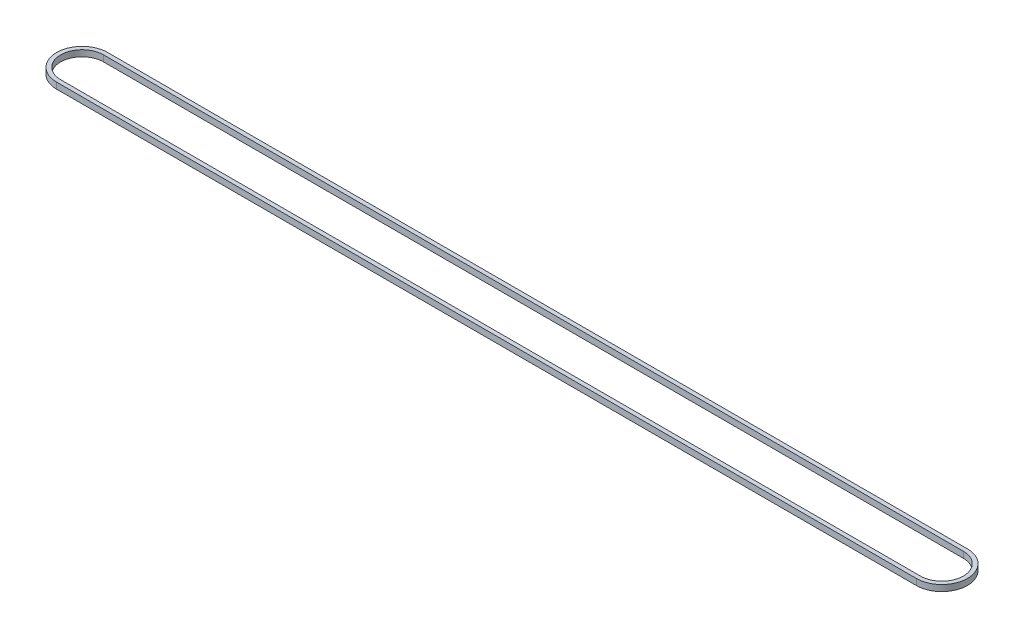
ISO-10303-21;
HEADER;
FILE_DESCRIPTION(('STEP AP214'),'2;1');
FILE_NAME('part.step','',(''),(''),'','','');
FILE_SCHEMA(('AUTOMOTIVE_DESIGN { 1 0 10303 214 1 1 1 1 }'));
ENDSEC;
DATA;
#1=APPLICATION_CONTEXT('core data for automotive mechanical design processes');
#2=APPLICATION_PROTOCOL_DEFINITION('international standard','automotive_design',2000,#1);
#3=PRODUCT_CONTEXT('',#1,'mechanical');
#4=PRODUCT('Part','Part','',(#3));
#5=PRODUCT_RELATED_PRODUCT_CATEGORY('part','',(#4));
#6=PRODUCT_DEFINITION_FORMATION('','',#4);
#7=PRODUCT_DEFINITION_CONTEXT('part definition',#1,'design');
#8=PRODUCT_DEFINITION('design','',#6,#7);
#9=PRODUCT_DEFINITION_SHAPE('','',#8);
#10=(LENGTH_UNIT() NAMED_UNIT(*) SI_UNIT(.MILLI.,.METRE.));
#11=(NAMED_UNIT(*) PLANE_ANGLE_UNIT() SI_UNIT($,.RADIAN.));
#12=(NAMED_UNIT(*) SI_UNIT($,.STERADIAN.) SOLID_ANGLE_UNIT());
#13=UNCERTAINTY_MEASURE_WITH_UNIT(LENGTH_MEASURE(1.E-05),#10,'distance_accuracy_value','');
#14=(GEOMETRIC_REPRESENTATION_CONTEXT(3) GLOBAL_UNCERTAINTY_ASSIGNED_CONTEXT((#13)) GLOBAL_UNIT_ASSIGNED_CONTEXT((#10,
#11,#12)) REPRESENTATION_CONTEXT('',''));
#15=CARTESIAN_POINT('',(0.,0.,0.));
#16=DIRECTION('',(0.,0.,1.));
#17=DIRECTION('',(1.,0.,0.));
#18=AXIS2_PLACEMENT_3D('',#15,#16,#17);
#19=CARTESIAN_POINT('',(-32.6689284068016,3.,0.));
#20=DIRECTION('',(0.,1.,0.));
#21=DIRECTION('',(0.,0.,1.));
#22=AXIS2_PLACEMENT_3D('',#19,#20,#21);
#23=PLANE('',#22);
#24=CARTESIAN_POINT('',(-32.6689284068016,3.,0.));
#25=DIRECTION('',(0.,1.,0.));
#26=DIRECTION('',(0.,0.,1.));
#27=AXIS2_PLACEMENT_3D('',#24,#25,#26);
#28=CIRCLE('',#27,12.5);
#29=CARTESIAN_POINT('',(-32.6689284068016,3.,-12.5));
#30=VERTEX_POINT('',#29);
#31=CARTESIAN_POINT('',(-32.6689284068016,3.,12.5));
#32=VERTEX_POINT('',#31);
#33=EDGE_CURVE('E133',#30,#32,#28,.T.);
#34=ORIENTED_EDGE('',*,*,#33,.T.);
#35=DIRECTION('',(1.,0.,0.));
#36=VECTOR('',#35,1.);
#37=CARTESIAN_POINT('',(-32.6689284068016,3.,12.5));
#38=LINE('',#37,#36);
#39=CARTESIAN_POINT('',(387.331071593198,3.,12.5));
#40=VERTEX_POINT('',#39);
#41=EDGE_CURVE('E136',#32,#40,#38,.T.);
#42=ORIENTED_EDGE('',*,*,#41,.T.);
#43=CARTESIAN_POINT('',(387.331071593198,3.,0.));
#44=DIRECTION('',(0.,1.,0.));
#45=DIRECTION('',(0.,0.,1.));
#46=AXIS2_PLACEMENT_3D('',#43,#44,#45);
#47=CIRCLE('',#46,12.5);
#48=CARTESIAN_POINT('',(387.331071593198,3.,-12.5));
#49=VERTEX_POINT('',#48);
#50=EDGE_CURVE('E139',#40,#49,#47,.T.);
#51=ORIENTED_EDGE('',*,*,#50,.T.);
#52=DIRECTION('',(-1.,0.,0.));
#53=VECTOR('',#52,1.);
#54=CARTESIAN_POINT('',(-32.6689284068016,3.,-12.5));
#55=LINE('',#54,#53);
#56=EDGE_CURVE('E141',#49,#30,#55,.T.);
#57=ORIENTED_EDGE('',*,*,#56,.T.);
#58=EDGE_LOOP('',(#34,#42,#51,#57));
#59=FACE_BOUND('',#58,.T.);
#60=DIRECTION('',(1.,0.,0.));
#61=VECTOR('',#60,1.);
#62=CARTESIAN_POINT('',(-32.6689284068016,3.,10.5));
#63=LINE('',#62,#61);
#64=CARTESIAN_POINT('',(-32.6689284068016,3.,10.5));
#65=VERTEX_POINT('',#64);
#66=CARTESIAN_POINT('',(387.331071593198,3.,10.5));
#67=VERTEX_POINT('',#66);
#68=EDGE_CURVE('E105',#65,#67,#63,.T.);
#69=ORIENTED_EDGE('',*,*,#68,.F.);
#70=CARTESIAN_POINT('',(-32.6689284068016,3.,0.));
#71=DIRECTION('',(0.,1.,0.));
#72=DIRECTION('',(0.,0.,1.));
#73=AXIS2_PLACEMENT_3D('',#70,#71,#72);
#74=CIRCLE('',#73,10.5);
#75=CARTESIAN_POINT('',(-32.6689284068016,3.,-10.5));
#76=VERTEX_POINT('',#75);
#77=EDGE_CURVE('E97',#76,#65,#74,.T.);
#78=ORIENTED_EDGE('',*,*,#77,.F.);
#79=DIRECTION('',(-1.,0.,0.));
#80=VECTOR('',#79,1.);
#81=CARTESIAN_POINT('',(-32.6689284068016,3.,-10.5));
#82=LINE('',#81,#80);
#83=CARTESIAN_POINT('',(387.331071593198,3.,-10.5));
#84=VERTEX_POINT('',#83);
#85=EDGE_CURVE('E119',#84,#76,#82,.T.);
#86=ORIENTED_EDGE('',*,*,#85,.F.);
#87=CARTESIAN_POINT('',(387.331071593198,3.,0.));
#88=DIRECTION('',(0.,1.,0.));
#89=DIRECTION('',(0.,0.,1.));
#90=AXIS2_PLACEMENT_3D('',#87,#88,#89);
#91=CIRCLE('',#90,10.5);
#92=EDGE_CURVE('E117',#67,#84,#91,.T.);
#93=ORIENTED_EDGE('',*,*,#92,.F.);
#94=EDGE_LOOP('',(#69,#78,#86,#93));
#95=FACE_BOUND('',#94,.T.);
#96=ADVANCED_FACE('F32',(#59,#95),#23,.T.);
#97=CARTESIAN_POINT('',(-32.6689284068016,0.,0.));
#98=DIRECTION('',(0.,1.,0.));
#99=DIRECTION('',(0.,0.,1.));
#100=AXIS2_PLACEMENT_3D('',#97,#98,#99);
#101=PLANE('',#100);
#102=CARTESIAN_POINT('',(-32.6689284068016,0.,0.));
#103=DIRECTION('',(0.,1.,0.));
#104=DIRECTION('',(0.,0.,1.));
#105=AXIS2_PLACEMENT_3D('',#102,#103,#104);
#106=CIRCLE('',#105,12.5);
#107=CARTESIAN_POINT('',(-32.6689284068016,0.,-12.5));
#108=VERTEX_POINT('',#107);
#109=CARTESIAN_POINT('',(-32.6689284068016,0.,12.5));
#110=VERTEX_POINT('',#109);
#111=EDGE_CURVE('E113',#108,#110,#106,.T.);
#112=ORIENTED_EDGE('',*,*,#111,.F.);
#113=DIRECTION('',(-1.,0.,0.));
#114=VECTOR('',#113,1.);
#115=CARTESIAN_POINT('',(-32.6689284068016,0.,-12.5));
#116=LINE('',#115,#114);
#117=CARTESIAN_POINT('',(387.331071593198,0.,-12.5));
#118=VERTEX_POINT('',#117);
#119=EDGE_CURVE('E137',#118,#108,#116,.T.);
#120=ORIENTED_EDGE('',*,*,#119,.F.);
#121=CARTESIAN_POINT('',(387.331071593198,0.,0.));
#122=DIRECTION('',(0.,1.,0.));
#123=DIRECTION('',(0.,0.,1.));
#124=AXIS2_PLACEMENT_3D('',#121,#122,#123);
#125=CIRCLE('',#124,12.5);
#126=CARTESIAN_POINT('',(387.331071593198,0.,12.5));
#127=VERTEX_POINT('',#126);
#128=EDGE_CURVE('E148',#127,#118,#125,.T.);
#129=ORIENTED_EDGE('',*,*,#128,.F.);
#130=DIRECTION('',(1.,0.,0.));
#131=VECTOR('',#130,1.);
#132=CARTESIAN_POINT('',(-32.6689284068016,0.,12.5));
#133=LINE('',#132,#131);
#134=EDGE_CURVE('E146',#110,#127,#133,.T.);
#135=ORIENTED_EDGE('',*,*,#134,.F.);
#136=EDGE_LOOP('',(#112,#120,#129,#135));
#137=FACE_BOUND('',#136,.T.);
#138=CARTESIAN_POINT('',(-32.6689284068016,0.,0.));
#139=DIRECTION('',(0.,1.,0.));
#140=DIRECTION('',(0.,0.,1.));
#141=AXIS2_PLACEMENT_3D('',#138,#139,#140);
#142=CIRCLE('',#141,10.5);
#143=CARTESIAN_POINT('',(-32.6689284068016,0.,-10.5));
#144=VERTEX_POINT('',#143);
#145=CARTESIAN_POINT('',(-32.6689284068016,0.,10.5));
#146=VERTEX_POINT('',#145);
#147=EDGE_CURVE('E55',#144,#146,#142,.T.);
#148=ORIENTED_EDGE('',*,*,#147,.T.);
#149=DIRECTION('',(1.,0.,0.));
#150=VECTOR('',#149,1.);
#151=CARTESIAN_POINT('',(-32.6689284068016,0.,10.5));
#152=LINE('',#151,#150);
#153=CARTESIAN_POINT('',(387.331071593198,0.,10.5));
#154=VERTEX_POINT('',#153);
#155=EDGE_CURVE('E112',#146,#154,#152,.T.);
#156=ORIENTED_EDGE('',*,*,#155,.T.);
#157=CARTESIAN_POINT('',(387.331071593198,0.,0.));
#158=DIRECTION('',(0.,1.,0.));
#159=DIRECTION('',(0.,0.,1.));
#160=AXIS2_PLACEMENT_3D('',#157,#158,#159);
#161=CIRCLE('',#160,10.5);
#162=CARTESIAN_POINT('',(387.331071593198,0.,-10.5));
#163=VERTEX_POINT('',#162);
#164=EDGE_CURVE('E125',#154,#163,#161,.T.);
#165=ORIENTED_EDGE('',*,*,#164,.T.);
#166=DIRECTION('',(-1.,0.,0.));
#167=VECTOR('',#166,1.);
#168=CARTESIAN_POINT('',(-32.6689284068016,0.,-10.5));
#169=LINE('',#168,#167);
#170=EDGE_CURVE('E106',#163,#144,#169,.T.);
#171=ORIENTED_EDGE('',*,*,#170,.T.);
#172=EDGE_LOOP('',(#148,#156,#165,#171));
#173=FACE_BOUND('',#172,.T.);
#174=ADVANCED_FACE('F166',(#137,#173),#101,.F.);
#175=CARTESIAN_POINT('',(-32.6689284068016,3.,0.));
#176=DIRECTION('',(0.,-1.,0.));
#177=DIRECTION('',(0.,0.,-1.));
#178=AXIS2_PLACEMENT_3D('',#175,#176,#177);
#179=CYLINDRICAL_SURFACE('',#178,12.5);
#180=ORIENTED_EDGE('',*,*,#111,.T.);
#181=DIRECTION('',(0.,-1.,0.));
#182=VECTOR('',#181,1.);
#183=CARTESIAN_POINT('',(-32.6689284068016,3.,12.5));
#184=LINE('',#183,#182);
#185=EDGE_CURVE('E11',#32,#110,#184,.T.);
#186=ORIENTED_EDGE('',*,*,#185,.F.);
#187=ORIENTED_EDGE('',*,*,#33,.F.);
#188=DIRECTION('',(0.,-1.,0.));
#189=VECTOR('',#188,1.);
#190=CARTESIAN_POINT('',(-32.6689284068016,3.,-12.5));
#191=LINE('',#190,#189);
#192=EDGE_CURVE('E143',#30,#108,#191,.T.);
#193=ORIENTED_EDGE('',*,*,#192,.T.);
#194=EDGE_LOOP('',(#180,#186,#187,#193));
#195=FACE_BOUND('',#194,.T.);
#196=ADVANCED_FACE('F34',(#195),#179,.T.);
#197=CARTESIAN_POINT('',(-32.6689284068016,3.,12.5));
#198=DIRECTION('',(0.,0.,-1.));
#199=DIRECTION('',(-1.,0.,0.));
#200=AXIS2_PLACEMENT_3D('',#197,#198,#199);
#201=PLANE('',#200);
#202=ORIENTED_EDGE('',*,*,#134,.T.);
#203=DIRECTION('',(0.,-1.,0.));
#204=VECTOR('',#203,1.);
#205=CARTESIAN_POINT('',(387.331071593198,3.,12.5));
#206=LINE('',#205,#204);
#207=EDGE_CURVE('E40',#40,#127,#206,.T.);
#208=ORIENTED_EDGE('',*,*,#207,.F.);
#209=ORIENTED_EDGE('',*,*,#41,.F.);
#210=ORIENTED_EDGE('',*,*,#185,.T.);
#211=EDGE_LOOP('',(#202,#208,#209,#210));
#212=FACE_BOUND('',#211,.T.);
#213=ADVANCED_FACE('F176',(#212),#201,.F.);
#214=CARTESIAN_POINT('',(387.331071593198,3.,0.));
#215=DIRECTION('',(0.,-1.,0.));
#216=DIRECTION('',(0.,0.,-1.));
#217=AXIS2_PLACEMENT_3D('',#214,#215,#216);
#218=CYLINDRICAL_SURFACE('',#217,12.5);
#219=ORIENTED_EDGE('',*,*,#128,.T.);
#220=DIRECTION('',(0.,-1.,0.));
#221=VECTOR('',#220,1.);
#222=CARTESIAN_POINT('',(387.331071593198,3.,-12.5));
#223=LINE('',#222,#221);
#224=EDGE_CURVE('E153',#49,#118,#223,.T.);
#225=ORIENTED_EDGE('',*,*,#224,.F.);
#226=ORIENTED_EDGE('',*,*,#50,.F.);
#227=ORIENTED_EDGE('',*,*,#207,.T.);
#228=EDGE_LOOP('',(#219,#225,#226,#227));
#229=FACE_BOUND('',#228,.T.);
#230=ADVANCED_FACE('F160',(#229),#218,.T.);
#231=CARTESIAN_POINT('',(-32.6689284068016,3.,-12.5));
#232=DIRECTION('',(0.,0.,1.));
#233=DIRECTION('',(1.,0.,0.));
#234=AXIS2_PLACEMENT_3D('',#231,#232,#233);
#235=PLANE('',#234);
#236=ORIENTED_EDGE('',*,*,#119,.T.);
#237=ORIENTED_EDGE('',*,*,#192,.F.);
#238=ORIENTED_EDGE('',*,*,#56,.F.);
#239=ORIENTED_EDGE('',*,*,#224,.T.);
#240=EDGE_LOOP('',(#236,#237,#238,#239));
#241=FACE_BOUND('',#240,.T.);
#242=ADVANCED_FACE('F170',(#241),#235,.F.);
#243=CARTESIAN_POINT('',(-32.6689284068016,3.,0.));
#244=DIRECTION('',(0.,-1.,0.));
#245=DIRECTION('',(0.,0.,-1.));
#246=AXIS2_PLACEMENT_3D('',#243,#244,#245);
#247=CYLINDRICAL_SURFACE('',#246,10.5);
#248=ORIENTED_EDGE('',*,*,#147,.F.);
#249=DIRECTION('',(0.,-1.,0.));
#250=VECTOR('',#249,1.);
#251=CARTESIAN_POINT('',(-32.6689284068016,3.,-10.5));
#252=LINE('',#251,#250);
#253=EDGE_CURVE('E101',#76,#144,#252,.T.);
#254=ORIENTED_EDGE('',*,*,#253,.F.);
#255=ORIENTED_EDGE('',*,*,#77,.T.);
#256=DIRECTION('',(0.,-1.,0.));
#257=VECTOR('',#256,1.);
#258=CARTESIAN_POINT('',(-32.6689284068016,3.,10.5));
#259=LINE('',#258,#257);
#260=EDGE_CURVE('E100',#65,#146,#259,.T.);
#261=ORIENTED_EDGE('',*,*,#260,.T.);
#262=EDGE_LOOP('',(#248,#254,#255,#261));
#263=FACE_BOUND('',#262,.T.);
#264=ADVANCED_FACE('F99',(#263),#247,.F.);
#265=CARTESIAN_POINT('',(-32.6689284068016,3.,10.5));
#266=DIRECTION('',(0.,0.,-1.));
#267=DIRECTION('',(-1.,0.,0.));
#268=AXIS2_PLACEMENT_3D('',#265,#266,#267);
#269=PLANE('',#268);
#270=ORIENTED_EDGE('',*,*,#155,.F.);
#271=ORIENTED_EDGE('',*,*,#260,.F.);
#272=ORIENTED_EDGE('',*,*,#68,.T.);
#273=DIRECTION('',(0.,-1.,0.));
#274=VECTOR('',#273,1.);
#275=CARTESIAN_POINT('',(387.331071593198,3.,10.5));
#276=LINE('',#275,#274);
#277=EDGE_CURVE('E114',#67,#154,#276,.T.);
#278=ORIENTED_EDGE('',*,*,#277,.T.);
#279=EDGE_LOOP('',(#270,#271,#272,#278));
#280=FACE_BOUND('',#279,.T.);
#281=ADVANCED_FACE('F109',(#280),#269,.T.);
#282=CARTESIAN_POINT('',(387.331071593198,3.,0.));
#283=DIRECTION('',(0.,-1.,0.));
#284=DIRECTION('',(0.,0.,-1.));
#285=AXIS2_PLACEMENT_3D('',#282,#283,#284);
#286=CYLINDRICAL_SURFACE('',#285,10.5);
#287=ORIENTED_EDGE('',*,*,#164,.F.);
#288=ORIENTED_EDGE('',*,*,#277,.F.);
#289=ORIENTED_EDGE('',*,*,#92,.T.);
#290=DIRECTION('',(0.,-1.,0.));
#291=VECTOR('',#290,1.);
#292=CARTESIAN_POINT('',(387.331071593198,3.,-10.5));
#293=LINE('',#292,#291);
#294=EDGE_CURVE('E47',#84,#163,#293,.T.);
#295=ORIENTED_EDGE('',*,*,#294,.T.);
#296=EDGE_LOOP('',(#287,#288,#289,#295));
#297=FACE_BOUND('',#296,.T.);
#298=ADVANCED_FACE('F199',(#297),#286,.F.);
#299=CARTESIAN_POINT('',(-32.6689284068016,3.,-10.5));
#300=DIRECTION('',(0.,0.,1.));
#301=DIRECTION('',(1.,0.,0.));
#302=AXIS2_PLACEMENT_3D('',#299,#300,#301);
#303=PLANE('',#302);
#304=ORIENTED_EDGE('',*,*,#170,.F.);
#305=ORIENTED_EDGE('',*,*,#294,.F.);
#306=ORIENTED_EDGE('',*,*,#85,.T.);
#307=ORIENTED_EDGE('',*,*,#253,.T.);
#308=EDGE_LOOP('',(#304,#305,#306,#307));
#309=FACE_BOUND('',#308,.T.);
#310=ADVANCED_FACE('F203',(#309),#303,.T.);
#311=CLOSED_SHELL('',(#96,#174,#196,#213,#230,#242,#264,#281,#298,#310));
#312=MANIFOLD_SOLID_BREP('B2',#311);
#313=ADVANCED_BREP_SHAPE_REPRESENTATION('',(#18,#312),#14);
#314=SHAPE_DEFINITION_REPRESENTATION(#9,#313);
ENDSEC;
END-ISO-10303-21;
